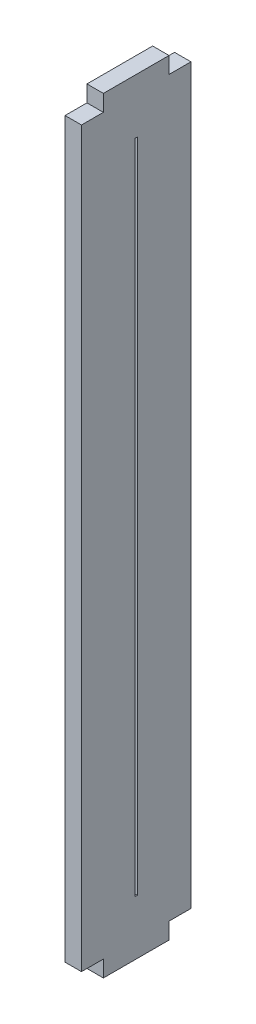
ISO-10303-21;
HEADER;
FILE_DESCRIPTION(('STEP AP214'),'2;1');
FILE_NAME('part.step','',(''),(''),'','','');
FILE_SCHEMA(('AUTOMOTIVE_DESIGN { 1 0 10303 214 1 1 1 1 }'));
ENDSEC;
DATA;
#1=APPLICATION_CONTEXT('core data for automotive mechanical design processes');
#2=APPLICATION_PROTOCOL_DEFINITION('international standard','automotive_design',2000,#1);
#3=PRODUCT_CONTEXT('',#1,'mechanical');
#4=PRODUCT('Part','Part','',(#3));
#5=PRODUCT_RELATED_PRODUCT_CATEGORY('part','',(#4));
#6=PRODUCT_DEFINITION_FORMATION('','',#4);
#7=PRODUCT_DEFINITION_CONTEXT('part definition',#1,'design');
#8=PRODUCT_DEFINITION('design','',#6,#7);
#9=PRODUCT_DEFINITION_SHAPE('','',#8);
#10=(LENGTH_UNIT() NAMED_UNIT(*) SI_UNIT(.MILLI.,.METRE.));
#11=(NAMED_UNIT(*) PLANE_ANGLE_UNIT() SI_UNIT($,.RADIAN.));
#12=(NAMED_UNIT(*) SI_UNIT($,.STERADIAN.) SOLID_ANGLE_UNIT());
#13=UNCERTAINTY_MEASURE_WITH_UNIT(LENGTH_MEASURE(1.E-05),#10,'distance_accuracy_value','');
#14=(GEOMETRIC_REPRESENTATION_CONTEXT(3) GLOBAL_UNCERTAINTY_ASSIGNED_CONTEXT((#13)) GLOBAL_UNIT_ASSIGNED_CONTEXT((#10,
#11,#12)) REPRESENTATION_CONTEXT('',''));
#15=CARTESIAN_POINT('',(0.,0.,0.));
#16=DIRECTION('',(0.,0.,1.));
#17=DIRECTION('',(1.,0.,0.));
#18=AXIS2_PLACEMENT_3D('',#15,#16,#17);
#19=CARTESIAN_POINT('',(1.5,-30.8441558441559,10.));
#20=DIRECTION('',(0.,0.,-1.));
#21=DIRECTION('',(-1.,0.,0.));
#22=AXIS2_PLACEMENT_3D('',#19,#20,#21);
#23=PLANE('',#22);
#24=DIRECTION('',(0.,-1.,0.));
#25=VECTOR('',#24,1.);
#26=CARTESIAN_POINT('',(0.,-30.8441558441559,10.));
#27=LINE('',#26,#25);
#28=CARTESIAN_POINT('',(0.,37.6558441558441,10.));
#29=VERTEX_POINT('',#28);
#30=CARTESIAN_POINT('',(0.,-29.3441558441559,10.));
#31=VERTEX_POINT('',#30);
#32=EDGE_CURVE('E219',#29,#31,#27,.T.);
#33=ORIENTED_EDGE('',*,*,#32,.T.);
#34=DIRECTION('',(1.,0.,0.));
#35=VECTOR('',#34,1.);
#36=CARTESIAN_POINT('',(-8.5,-29.3441558441559,10.));
#37=LINE('',#36,#35);
#38=CARTESIAN_POINT('',(1.5,-29.3441558441559,10.));
#39=VERTEX_POINT('',#38);
#40=EDGE_CURVE('E208',#31,#39,#37,.T.);
#41=ORIENTED_EDGE('',*,*,#40,.T.);
#42=DIRECTION('',(0.,-1.,0.));
#43=VECTOR('',#42,1.);
#44=CARTESIAN_POINT('',(1.5,-30.8441558441559,10.));
#45=LINE('',#44,#43);
#46=CARTESIAN_POINT('',(1.5,37.6558441558441,10.));
#47=VERTEX_POINT('',#46);
#48=EDGE_CURVE('E224',#47,#39,#45,.T.);
#49=ORIENTED_EDGE('',*,*,#48,.F.);
#50=DIRECTION('',(1.,0.,0.));
#51=VECTOR('',#50,1.);
#52=CARTESIAN_POINT('',(-8.5,37.6558441558441,10.));
#53=LINE('',#52,#51);
#54=EDGE_CURVE('E220',#29,#47,#53,.T.);
#55=ORIENTED_EDGE('',*,*,#54,.F.);
#56=EDGE_LOOP('',(#33,#41,#49,#55));
#57=FACE_BOUND('',#56,.T.);
#58=ADVANCED_FACE('F36',(#57),#23,.F.);
#59=CARTESIAN_POINT('',(1.5,-30.8441558441559,10.));
#60=DIRECTION('',(0.,1.,0.));
#61=DIRECTION('',(0.,0.,1.));
#62=AXIS2_PLACEMENT_3D('',#59,#60,#61);
#63=PLANE('',#62);
#64=DIRECTION('',(0.,0.,-1.));
#65=VECTOR('',#64,1.);
#66=CARTESIAN_POINT('',(1.5,-30.8441558441559,10.));
#67=LINE('',#66,#65);
#68=CARTESIAN_POINT('',(1.5,-30.8441558441559,8.));
#69=VERTEX_POINT('',#68);
#70=CARTESIAN_POINT('',(1.5,-30.8441558441559,2.));
#71=VERTEX_POINT('',#70);
#72=EDGE_CURVE('E227',#69,#71,#67,.T.);
#73=ORIENTED_EDGE('',*,*,#72,.F.);
#74=DIRECTION('',(1.,0.,0.));
#75=VECTOR('',#74,1.);
#76=CARTESIAN_POINT('',(-8.5,-30.8441558441559,8.));
#77=LINE('',#76,#75);
#78=CARTESIAN_POINT('',(0.,-30.8441558441559,8.));
#79=VERTEX_POINT('',#78);
#80=EDGE_CURVE('E193',#79,#69,#77,.T.);
#81=ORIENTED_EDGE('',*,*,#80,.F.);
#82=DIRECTION('',(0.,0.,-1.));
#83=VECTOR('',#82,1.);
#84=CARTESIAN_POINT('',(0.,-30.8441558441559,10.));
#85=LINE('',#84,#83);
#86=CARTESIAN_POINT('',(0.,-30.8441558441559,2.));
#87=VERTEX_POINT('',#86);
#88=EDGE_CURVE('E240',#79,#87,#85,.T.);
#89=ORIENTED_EDGE('',*,*,#88,.T.);
#90=DIRECTION('',(1.,0.,0.));
#91=VECTOR('',#90,1.);
#92=CARTESIAN_POINT('',(-8.5,-30.8441558441559,2.));
#93=LINE('',#92,#91);
#94=EDGE_CURVE('E196',#87,#71,#93,.T.);
#95=ORIENTED_EDGE('',*,*,#94,.T.);
#96=EDGE_LOOP('',(#73,#81,#89,#95));
#97=FACE_BOUND('',#96,.T.);
#98=ADVANCED_FACE('F290',(#97),#63,.F.);
#99=CARTESIAN_POINT('',(1.5,-30.8441558441559,0.));
#100=DIRECTION('',(0.,0.,1.));
#101=DIRECTION('',(1.,0.,0.));
#102=AXIS2_PLACEMENT_3D('',#99,#100,#101);
#103=PLANE('',#102);
#104=DIRECTION('',(0.,1.,0.));
#105=VECTOR('',#104,1.);
#106=CARTESIAN_POINT('',(1.5,-30.8441558441559,0.));
#107=LINE('',#106,#105);
#108=CARTESIAN_POINT('',(1.5,-29.3441558441559,0.));
#109=VERTEX_POINT('',#108);
#110=CARTESIAN_POINT('',(1.5,37.6558441558441,0.));
#111=VERTEX_POINT('',#110);
#112=EDGE_CURVE('E231',#109,#111,#107,.T.);
#113=ORIENTED_EDGE('',*,*,#112,.F.);
#114=DIRECTION('',(1.,0.,0.));
#115=VECTOR('',#114,1.);
#116=CARTESIAN_POINT('',(-8.5,-29.3441558441559,0.));
#117=LINE('',#116,#115);
#118=CARTESIAN_POINT('',(0.,-29.3441558441559,0.));
#119=VERTEX_POINT('',#118);
#120=EDGE_CURVE('E198',#119,#109,#117,.T.);
#121=ORIENTED_EDGE('',*,*,#120,.F.);
#122=DIRECTION('',(0.,1.,0.));
#123=VECTOR('',#122,1.);
#124=CARTESIAN_POINT('',(0.,-30.8441558441559,0.));
#125=LINE('',#124,#123);
#126=CARTESIAN_POINT('',(0.,37.6558441558441,0.));
#127=VERTEX_POINT('',#126);
#128=EDGE_CURVE('E243',#119,#127,#125,.T.);
#129=ORIENTED_EDGE('',*,*,#128,.T.);
#130=DIRECTION('',(1.,0.,0.));
#131=VECTOR('',#130,1.);
#132=CARTESIAN_POINT('',(-8.5,37.6558441558441,0.));
#133=LINE('',#132,#131);
#134=EDGE_CURVE('E186',#127,#111,#133,.T.);
#135=ORIENTED_EDGE('',*,*,#134,.T.);
#136=EDGE_LOOP('',(#113,#121,#129,#135));
#137=FACE_BOUND('',#136,.T.);
#138=ADVANCED_FACE('F295',(#137),#103,.F.);
#139=CARTESIAN_POINT('',(1.5,39.1558441558441,10.));
#140=DIRECTION('',(0.,-1.,0.));
#141=DIRECTION('',(0.,0.,-1.));
#142=AXIS2_PLACEMENT_3D('',#139,#140,#141);
#143=PLANE('',#142);
#144=DIRECTION('',(0.,0.,1.));
#145=VECTOR('',#144,1.);
#146=CARTESIAN_POINT('',(1.5,39.1558441558441,10.));
#147=LINE('',#146,#145);
#148=CARTESIAN_POINT('',(1.5,39.1558441558441,2.));
#149=VERTEX_POINT('',#148);
#150=CARTESIAN_POINT('',(1.5,39.1558441558441,8.));
#151=VERTEX_POINT('',#150);
#152=EDGE_CURVE('E234',#149,#151,#147,.T.);
#153=ORIENTED_EDGE('',*,*,#152,.F.);
#154=DIRECTION('',(1.,0.,0.));
#155=VECTOR('',#154,1.);
#156=CARTESIAN_POINT('',(-8.5,39.1558441558441,2.));
#157=LINE('',#156,#155);
#158=CARTESIAN_POINT('',(0.,39.1558441558441,2.));
#159=VERTEX_POINT('',#158);
#160=EDGE_CURVE('E183',#159,#149,#157,.T.);
#161=ORIENTED_EDGE('',*,*,#160,.F.);
#162=DIRECTION('',(0.,0.,1.));
#163=VECTOR('',#162,1.);
#164=CARTESIAN_POINT('',(0.,39.1558441558441,10.));
#165=LINE('',#164,#163);
#166=CARTESIAN_POINT('',(0.,39.1558441558441,8.));
#167=VERTEX_POINT('',#166);
#168=EDGE_CURVE('E228',#159,#167,#165,.T.);
#169=ORIENTED_EDGE('',*,*,#168,.T.);
#170=DIRECTION('',(1.,0.,0.));
#171=VECTOR('',#170,1.);
#172=CARTESIAN_POINT('',(-8.5,39.1558441558441,8.));
#173=LINE('',#172,#171);
#174=EDGE_CURVE('E216',#167,#151,#173,.T.);
#175=ORIENTED_EDGE('',*,*,#174,.T.);
#176=EDGE_LOOP('',(#153,#161,#169,#175));
#177=FACE_BOUND('',#176,.T.);
#178=ADVANCED_FACE('F322',(#177),#143,.F.);
#179=CARTESIAN_POINT('',(1.5,0.,0.));
#180=DIRECTION('',(-1.,0.,0.));
#181=DIRECTION('',(0.,0.,1.));
#182=AXIS2_PLACEMENT_3D('',#179,#180,#181);
#183=PLANE('',#182);
#184=DIRECTION('',(0.,0.,-1.));
#185=VECTOR('',#184,1.);
#186=CARTESIAN_POINT('',(1.5,-25.8441558441559,5.09999999999999));
#187=LINE('',#186,#185);
#188=CARTESIAN_POINT('',(1.5,-25.8441558441559,5.09999999999999));
#189=VERTEX_POINT('',#188);
#190=CARTESIAN_POINT('',(1.5,-25.8441558441559,4.89999999999999));
#191=VERTEX_POINT('',#190);
#192=EDGE_CURVE('E159',#189,#191,#187,.T.);
#193=ORIENTED_EDGE('',*,*,#192,.F.);
#194=DIRECTION('',(0.,-1.,0.));
#195=VECTOR('',#194,1.);
#196=CARTESIAN_POINT('',(1.5,34.1558441558442,5.1));
#197=LINE('',#196,#195);
#198=CARTESIAN_POINT('',(1.5,34.1558441558442,5.1));
#199=VERTEX_POINT('',#198);
#200=EDGE_CURVE('E50',#199,#189,#197,.T.);
#201=ORIENTED_EDGE('',*,*,#200,.F.);
#202=DIRECTION('',(0.,0.,1.));
#203=VECTOR('',#202,1.);
#204=CARTESIAN_POINT('',(1.5,34.1558441558442,5.1));
#205=LINE('',#204,#203);
#206=CARTESIAN_POINT('',(1.5,34.1558441558442,4.9));
#207=VERTEX_POINT('',#206);
#208=EDGE_CURVE('E166',#207,#199,#205,.T.);
#209=ORIENTED_EDGE('',*,*,#208,.F.);
#210=DIRECTION('',(0.,1.,0.));
#211=VECTOR('',#210,1.);
#212=CARTESIAN_POINT('',(1.5,34.1558441558442,4.9));
#213=LINE('',#212,#211);
#214=EDGE_CURVE('E150',#191,#207,#213,.T.);
#215=ORIENTED_EDGE('',*,*,#214,.F.);
#216=EDGE_LOOP('',(#193,#201,#209,#215));
#217=FACE_BOUND('',#216,.T.);
#218=DIRECTION('',(0.,0.,1.));
#219=VECTOR('',#218,1.);
#220=CARTESIAN_POINT('',(1.5,-29.3441558441559,8.));
#221=LINE('',#220,#219);
#222=CARTESIAN_POINT('',(1.5,-29.3441558441559,8.));
#223=VERTEX_POINT('',#222);
#224=EDGE_CURVE('E204',#223,#39,#221,.T.);
#225=ORIENTED_EDGE('',*,*,#224,.F.);
#226=DIRECTION('',(0.,1.,0.));
#227=VECTOR('',#226,1.);
#228=CARTESIAN_POINT('',(1.5,-30.8441558441559,8.));
#229=LINE('',#228,#227);
#230=EDGE_CURVE('E173',#69,#223,#229,.T.);
#231=ORIENTED_EDGE('',*,*,#230,.F.);
#232=ORIENTED_EDGE('',*,*,#72,.T.);
#233=DIRECTION('',(0.,-1.,0.));
#234=VECTOR('',#233,1.);
#235=CARTESIAN_POINT('',(1.5,-30.8441558441559,2.));
#236=LINE('',#235,#234);
#237=CARTESIAN_POINT('',(1.5,-29.3441558441559,2.));
#238=VERTEX_POINT('',#237);
#239=EDGE_CURVE('E190',#238,#71,#236,.T.);
#240=ORIENTED_EDGE('',*,*,#239,.F.);
#241=DIRECTION('',(0.,0.,1.));
#242=VECTOR('',#241,1.);
#243=CARTESIAN_POINT('',(1.5,-29.3441558441559,2.));
#244=LINE('',#243,#242);
#245=EDGE_CURVE('E192',#109,#238,#244,.T.);
#246=ORIENTED_EDGE('',*,*,#245,.F.);
#247=ORIENTED_EDGE('',*,*,#112,.T.);
#248=DIRECTION('',(0.,0.,-1.));
#249=VECTOR('',#248,1.);
#250=CARTESIAN_POINT('',(1.5,37.6558441558441,2.));
#251=LINE('',#250,#249);
#252=CARTESIAN_POINT('',(1.5,37.6558441558441,2.));
#253=VERTEX_POINT('',#252);
#254=EDGE_CURVE('E179',#253,#111,#251,.T.);
#255=ORIENTED_EDGE('',*,*,#254,.F.);
#256=DIRECTION('',(0.,-1.,0.));
#257=VECTOR('',#256,1.);
#258=CARTESIAN_POINT('',(1.5,39.1558441558441,2.));
#259=LINE('',#258,#257);
#260=EDGE_CURVE('E176',#149,#253,#259,.T.);
#261=ORIENTED_EDGE('',*,*,#260,.F.);
#262=ORIENTED_EDGE('',*,*,#152,.T.);
#263=DIRECTION('',(0.,1.,0.));
#264=VECTOR('',#263,1.);
#265=CARTESIAN_POINT('',(1.5,39.1558441558441,8.));
#266=LINE('',#265,#264);
#267=CARTESIAN_POINT('',(1.5,37.6558441558441,8.));
#268=VERTEX_POINT('',#267);
#269=EDGE_CURVE('E185',#268,#151,#266,.T.);
#270=ORIENTED_EDGE('',*,*,#269,.F.);
#271=DIRECTION('',(0.,0.,-1.));
#272=VECTOR('',#271,1.);
#273=CARTESIAN_POINT('',(1.5,37.6558441558441,8.));
#274=LINE('',#273,#272);
#275=EDGE_CURVE('E213',#47,#268,#274,.T.);
#276=ORIENTED_EDGE('',*,*,#275,.F.);
#277=ORIENTED_EDGE('',*,*,#48,.T.);
#278=EDGE_LOOP('',(#225,#231,#232,#240,#246,#247,#255,#261,#262,#270,#276,#277));
#279=FACE_BOUND('',#278,.T.);
#280=ADVANCED_FACE('F163',(#217,#279),#183,.F.);
#281=CARTESIAN_POINT('',(0.,0.,0.));
#282=DIRECTION('',(-1.,0.,0.));
#283=DIRECTION('',(0.,0.,1.));
#284=AXIS2_PLACEMENT_3D('',#281,#282,#283);
#285=PLANE('',#284);
#286=DIRECTION('',(0.,1.,0.));
#287=VECTOR('',#286,1.);
#288=CARTESIAN_POINT('',(0.,0.,5.1));
#289=LINE('',#288,#287);
#290=CARTESIAN_POINT('',(0.,-25.8441558441559,5.09999999999999));
#291=VERTEX_POINT('',#290);
#292=CARTESIAN_POINT('',(0.,34.1558441558442,5.1));
#293=VERTEX_POINT('',#292);
#294=EDGE_CURVE('E11',#291,#293,#289,.T.);
#295=ORIENTED_EDGE('',*,*,#294,.F.);
#296=DIRECTION('',(0.,0.,1.));
#297=VECTOR('',#296,1.);
#298=CARTESIAN_POINT('',(0.,-25.8441558441559,0.));
#299=LINE('',#298,#297);
#300=CARTESIAN_POINT('',(0.,-25.8441558441559,4.89999999999999));
#301=VERTEX_POINT('',#300);
#302=EDGE_CURVE('E265',#301,#291,#299,.T.);
#303=ORIENTED_EDGE('',*,*,#302,.F.);
#304=DIRECTION('',(0.,-1.,0.));
#305=VECTOR('',#304,1.);
#306=CARTESIAN_POINT('',(0.,0.,4.9));
#307=LINE('',#306,#305);
#308=CARTESIAN_POINT('',(0.,34.1558441558442,4.9));
#309=VERTEX_POINT('',#308);
#310=EDGE_CURVE('E153',#309,#301,#307,.T.);
#311=ORIENTED_EDGE('',*,*,#310,.F.);
#312=DIRECTION('',(0.,0.,-1.));
#313=VECTOR('',#312,1.);
#314=CARTESIAN_POINT('',(0.,34.1558441558442,0.));
#315=LINE('',#314,#313);
#316=EDGE_CURVE('E43',#293,#309,#315,.T.);
#317=ORIENTED_EDGE('',*,*,#316,.F.);
#318=EDGE_LOOP('',(#295,#303,#311,#317));
#319=FACE_BOUND('',#318,.T.);
#320=DIRECTION('',(0.,-1.,0.));
#321=VECTOR('',#320,1.);
#322=CARTESIAN_POINT('',(0.,0.,8.));
#323=LINE('',#322,#321);
#324=CARTESIAN_POINT('',(0.,-29.3441558441559,8.));
#325=VERTEX_POINT('',#324);
#326=EDGE_CURVE('E263',#325,#79,#323,.T.);
#327=ORIENTED_EDGE('',*,*,#326,.F.);
#328=DIRECTION('',(0.,0.,-1.));
#329=VECTOR('',#328,1.);
#330=CARTESIAN_POINT('',(0.,-29.3441558441559,0.));
#331=LINE('',#330,#329);
#332=EDGE_CURVE('E261',#31,#325,#331,.T.);
#333=ORIENTED_EDGE('',*,*,#332,.F.);
#334=ORIENTED_EDGE('',*,*,#32,.F.);
#335=DIRECTION('',(0.,0.,1.));
#336=VECTOR('',#335,1.);
#337=CARTESIAN_POINT('',(0.,37.6558441558441,0.));
#338=LINE('',#337,#336);
#339=CARTESIAN_POINT('',(0.,37.6558441558441,8.));
#340=VERTEX_POINT('',#339);
#341=EDGE_CURVE('E237',#340,#29,#338,.T.);
#342=ORIENTED_EDGE('',*,*,#341,.F.);
#343=DIRECTION('',(0.,-1.,0.));
#344=VECTOR('',#343,1.);
#345=CARTESIAN_POINT('',(0.,0.,8.));
#346=LINE('',#345,#344);
#347=EDGE_CURVE('E249',#167,#340,#346,.T.);
#348=ORIENTED_EDGE('',*,*,#347,.F.);
#349=ORIENTED_EDGE('',*,*,#168,.F.);
#350=DIRECTION('',(0.,1.,0.));
#351=VECTOR('',#350,1.);
#352=CARTESIAN_POINT('',(0.,0.,2.));
#353=LINE('',#352,#351);
#354=CARTESIAN_POINT('',(0.,37.6558441558441,2.));
#355=VERTEX_POINT('',#354);
#356=EDGE_CURVE('E254',#355,#159,#353,.T.);
#357=ORIENTED_EDGE('',*,*,#356,.F.);
#358=DIRECTION('',(0.,0.,1.));
#359=VECTOR('',#358,1.);
#360=CARTESIAN_POINT('',(0.,37.6558441558441,0.));
#361=LINE('',#360,#359);
#362=EDGE_CURVE('E252',#127,#355,#361,.T.);
#363=ORIENTED_EDGE('',*,*,#362,.F.);
#364=ORIENTED_EDGE('',*,*,#128,.F.);
#365=DIRECTION('',(0.,0.,-1.));
#366=VECTOR('',#365,1.);
#367=CARTESIAN_POINT('',(0.,-29.3441558441559,0.));
#368=LINE('',#367,#366);
#369=CARTESIAN_POINT('',(0.,-29.3441558441559,2.));
#370=VERTEX_POINT('',#369);
#371=EDGE_CURVE('E256',#370,#119,#368,.T.);
#372=ORIENTED_EDGE('',*,*,#371,.F.);
#373=DIRECTION('',(0.,1.,0.));
#374=VECTOR('',#373,1.);
#375=CARTESIAN_POINT('',(0.,0.,2.));
#376=LINE('',#375,#374);
#377=EDGE_CURVE('E258',#87,#370,#376,.T.);
#378=ORIENTED_EDGE('',*,*,#377,.F.);
#379=ORIENTED_EDGE('',*,*,#88,.F.);
#380=EDGE_LOOP('',(#327,#333,#334,#342,#348,#349,#357,#363,#364,#372,#378,#379));
#381=FACE_BOUND('',#380,.T.);
#382=ADVANCED_FACE('F273',(#319,#381),#285,.T.);
#383=CARTESIAN_POINT('',(-8.5,39.1558441558441,8.));
#384=DIRECTION('',(0.,0.,-1.));
#385=DIRECTION('',(-1.,0.,0.));
#386=AXIS2_PLACEMENT_3D('',#383,#384,#385);
#387=PLANE('',#386);
#388=ORIENTED_EDGE('',*,*,#347,.T.);
#389=DIRECTION('',(1.,0.,0.));
#390=VECTOR('',#389,1.);
#391=CARTESIAN_POINT('',(-8.5,37.6558441558441,8.));
#392=LINE('',#391,#390);
#393=EDGE_CURVE('E217',#340,#268,#392,.T.);
#394=ORIENTED_EDGE('',*,*,#393,.T.);
#395=ORIENTED_EDGE('',*,*,#269,.T.);
#396=ORIENTED_EDGE('',*,*,#174,.F.);
#397=EDGE_LOOP('',(#388,#394,#395,#396));
#398=FACE_BOUND('',#397,.T.);
#399=ADVANCED_FACE('F316',(#398),#387,.F.);
#400=CARTESIAN_POINT('',(-8.5,37.6558441558441,8.));
#401=DIRECTION('',(0.,-1.,0.));
#402=DIRECTION('',(0.,0.,-1.));
#403=AXIS2_PLACEMENT_3D('',#400,#401,#402);
#404=PLANE('',#403);
#405=ORIENTED_EDGE('',*,*,#341,.T.);
#406=ORIENTED_EDGE('',*,*,#54,.T.);
#407=ORIENTED_EDGE('',*,*,#275,.T.);
#408=ORIENTED_EDGE('',*,*,#393,.F.);
#409=EDGE_LOOP('',(#405,#406,#407,#408));
#410=FACE_BOUND('',#409,.T.);
#411=ADVANCED_FACE('F314',(#410),#404,.F.);
#412=CARTESIAN_POINT('',(-8.5,39.1558441558441,2.));
#413=DIRECTION('',(0.,0.,1.));
#414=DIRECTION('',(1.,0.,0.));
#415=AXIS2_PLACEMENT_3D('',#412,#413,#414);
#416=PLANE('',#415);
#417=ORIENTED_EDGE('',*,*,#356,.T.);
#418=ORIENTED_EDGE('',*,*,#160,.T.);
#419=ORIENTED_EDGE('',*,*,#260,.T.);
#420=DIRECTION('',(1.,0.,0.));
#421=VECTOR('',#420,1.);
#422=CARTESIAN_POINT('',(-8.5,37.6558441558441,2.));
#423=LINE('',#422,#421);
#424=EDGE_CURVE('E182',#355,#253,#423,.T.);
#425=ORIENTED_EDGE('',*,*,#424,.F.);
#426=EDGE_LOOP('',(#417,#418,#419,#425));
#427=FACE_BOUND('',#426,.T.);
#428=ADVANCED_FACE('F325',(#427),#416,.F.);
#429=CARTESIAN_POINT('',(-8.5,37.6558441558441,2.));
#430=DIRECTION('',(0.,-1.,0.));
#431=DIRECTION('',(0.,0.,-1.));
#432=AXIS2_PLACEMENT_3D('',#429,#430,#431);
#433=PLANE('',#432);
#434=ORIENTED_EDGE('',*,*,#362,.T.);
#435=ORIENTED_EDGE('',*,*,#424,.T.);
#436=ORIENTED_EDGE('',*,*,#254,.T.);
#437=ORIENTED_EDGE('',*,*,#134,.F.);
#438=EDGE_LOOP('',(#434,#435,#436,#437));
#439=FACE_BOUND('',#438,.T.);
#440=ADVANCED_FACE('F331',(#439),#433,.F.);
#441=CARTESIAN_POINT('',(-8.5,-30.8441558441559,2.));
#442=DIRECTION('',(0.,0.,1.));
#443=DIRECTION('',(1.,0.,0.));
#444=AXIS2_PLACEMENT_3D('',#441,#442,#443);
#445=PLANE('',#444);
#446=ORIENTED_EDGE('',*,*,#377,.T.);
#447=DIRECTION('',(1.,0.,0.));
#448=VECTOR('',#447,1.);
#449=CARTESIAN_POINT('',(-8.5,-29.3441558441559,2.));
#450=LINE('',#449,#448);
#451=EDGE_CURVE('E180',#370,#238,#450,.T.);
#452=ORIENTED_EDGE('',*,*,#451,.T.);
#453=ORIENTED_EDGE('',*,*,#239,.T.);
#454=ORIENTED_EDGE('',*,*,#94,.F.);
#455=EDGE_LOOP('',(#446,#452,#453,#454));
#456=FACE_BOUND('',#455,.T.);
#457=ADVANCED_FACE('F342',(#456),#445,.F.);
#458=CARTESIAN_POINT('',(-8.5,-29.3441558441559,2.));
#459=DIRECTION('',(0.,1.,0.));
#460=DIRECTION('',(0.,0.,1.));
#461=AXIS2_PLACEMENT_3D('',#458,#459,#460);
#462=PLANE('',#461);
#463=ORIENTED_EDGE('',*,*,#371,.T.);
#464=ORIENTED_EDGE('',*,*,#120,.T.);
#465=ORIENTED_EDGE('',*,*,#245,.T.);
#466=ORIENTED_EDGE('',*,*,#451,.F.);
#467=EDGE_LOOP('',(#463,#464,#465,#466));
#468=FACE_BOUND('',#467,.T.);
#469=ADVANCED_FACE('F339',(#468),#462,.F.);
#470=CARTESIAN_POINT('',(-8.5,-30.8441558441559,8.));
#471=DIRECTION('',(0.,0.,-1.));
#472=DIRECTION('',(-1.,0.,0.));
#473=AXIS2_PLACEMENT_3D('',#470,#471,#472);
#474=PLANE('',#473);
#475=ORIENTED_EDGE('',*,*,#326,.T.);
#476=ORIENTED_EDGE('',*,*,#80,.T.);
#477=ORIENTED_EDGE('',*,*,#230,.T.);
#478=DIRECTION('',(1.,0.,0.));
#479=VECTOR('',#478,1.);
#480=CARTESIAN_POINT('',(-8.5,-29.3441558441559,8.));
#481=LINE('',#480,#479);
#482=EDGE_CURVE('E206',#325,#223,#481,.T.);
#483=ORIENTED_EDGE('',*,*,#482,.F.);
#484=EDGE_LOOP('',(#475,#476,#477,#483));
#485=FACE_BOUND('',#484,.T.);
#486=ADVANCED_FACE('F284',(#485),#474,.F.);
#487=CARTESIAN_POINT('',(-8.5,-29.3441558441559,8.));
#488=DIRECTION('',(0.,1.,0.));
#489=DIRECTION('',(0.,0.,1.));
#490=AXIS2_PLACEMENT_3D('',#487,#488,#489);
#491=PLANE('',#490);
#492=ORIENTED_EDGE('',*,*,#332,.T.);
#493=ORIENTED_EDGE('',*,*,#482,.T.);
#494=ORIENTED_EDGE('',*,*,#224,.T.);
#495=ORIENTED_EDGE('',*,*,#40,.F.);
#496=EDGE_LOOP('',(#492,#493,#494,#495));
#497=FACE_BOUND('',#496,.T.);
#498=ADVANCED_FACE('F277',(#497),#491,.F.);
#499=CARTESIAN_POINT('',(-8.5,34.1558441558442,5.1));
#500=DIRECTION('',(0.,0.,1.));
#501=DIRECTION('',(0.,-1.,0.));
#502=AXIS2_PLACEMENT_3D('',#499,#500,#501);
#503=PLANE('',#502);
#504=ORIENTED_EDGE('',*,*,#294,.T.);
#505=DIRECTION('',(1.,0.,0.));
#506=VECTOR('',#505,1.);
#507=CARTESIAN_POINT('',(-8.5,34.1558441558442,5.1));
#508=LINE('',#507,#506);
#509=EDGE_CURVE('E171',#293,#199,#508,.T.);
#510=ORIENTED_EDGE('',*,*,#509,.T.);
#511=ORIENTED_EDGE('',*,*,#200,.T.);
#512=DIRECTION('',(1.,0.,0.));
#513=VECTOR('',#512,1.);
#514=CARTESIAN_POINT('',(-8.5,-25.8441558441559,5.09999999999999));
#515=LINE('',#514,#513);
#516=EDGE_CURVE('E156',#291,#189,#515,.T.);
#517=ORIENTED_EDGE('',*,*,#516,.F.);
#518=EDGE_LOOP('',(#504,#510,#511,#517));
#519=FACE_BOUND('',#518,.T.);
#520=ADVANCED_FACE('F275',(#519),#503,.F.);
#521=CARTESIAN_POINT('',(-8.5,34.1558441558442,5.1));
#522=DIRECTION('',(0.,1.,0.));
#523=DIRECTION('',(0.,0.,1.));
#524=AXIS2_PLACEMENT_3D('',#521,#522,#523);
#525=PLANE('',#524);
#526=ORIENTED_EDGE('',*,*,#316,.T.);
#527=DIRECTION('',(1.,0.,0.));
#528=VECTOR('',#527,1.);
#529=CARTESIAN_POINT('',(-8.5,34.1558441558442,4.9));
#530=LINE('',#529,#528);
#531=EDGE_CURVE('E155',#309,#207,#530,.T.);
#532=ORIENTED_EDGE('',*,*,#531,.T.);
#533=ORIENTED_EDGE('',*,*,#208,.T.);
#534=ORIENTED_EDGE('',*,*,#509,.F.);
#535=EDGE_LOOP('',(#526,#532,#533,#534));
#536=FACE_BOUND('',#535,.T.);
#537=ADVANCED_FACE('F270',(#536),#525,.F.);
#538=CARTESIAN_POINT('',(-8.5,34.1558441558442,4.9));
#539=DIRECTION('',(0.,0.,-1.));
#540=DIRECTION('',(0.,1.,0.));
#541=AXIS2_PLACEMENT_3D('',#538,#539,#540);
#542=PLANE('',#541);
#543=ORIENTED_EDGE('',*,*,#310,.T.);
#544=DIRECTION('',(1.,0.,0.));
#545=VECTOR('',#544,1.);
#546=CARTESIAN_POINT('',(-8.5,-25.8441558441559,4.89999999999999));
#547=LINE('',#546,#545);
#548=EDGE_CURVE('E58',#301,#191,#547,.T.);
#549=ORIENTED_EDGE('',*,*,#548,.T.);
#550=ORIENTED_EDGE('',*,*,#214,.T.);
#551=ORIENTED_EDGE('',*,*,#531,.F.);
#552=EDGE_LOOP('',(#543,#549,#550,#551));
#553=FACE_BOUND('',#552,.T.);
#554=ADVANCED_FACE('F147',(#553),#542,.F.);
#555=CARTESIAN_POINT('',(-8.5,-25.8441558441559,5.09999999999999));
#556=DIRECTION('',(0.,-1.,0.));
#557=DIRECTION('',(0.,0.,-1.));
#558=AXIS2_PLACEMENT_3D('',#555,#556,#557);
#559=PLANE('',#558);
#560=ORIENTED_EDGE('',*,*,#302,.T.);
#561=ORIENTED_EDGE('',*,*,#516,.T.);
#562=ORIENTED_EDGE('',*,*,#192,.T.);
#563=ORIENTED_EDGE('',*,*,#548,.F.);
#564=EDGE_LOOP('',(#560,#561,#562,#563));
#565=FACE_BOUND('',#564,.T.);
#566=ADVANCED_FACE('F160',(#565),#559,.F.);
#567=CLOSED_SHELL('',(#58,#98,#138,#178,#280,#382,#399,#411,#428,#440,#457,#469,#486,#498,#520,
#537,#554,#566));
#568=MANIFOLD_SOLID_BREP('B2',#567);
#569=ADVANCED_BREP_SHAPE_REPRESENTATION('',(#18,#568),#14);
#570=SHAPE_DEFINITION_REPRESENTATION(#9,#569);
ENDSEC;
END-ISO-10303-21;
